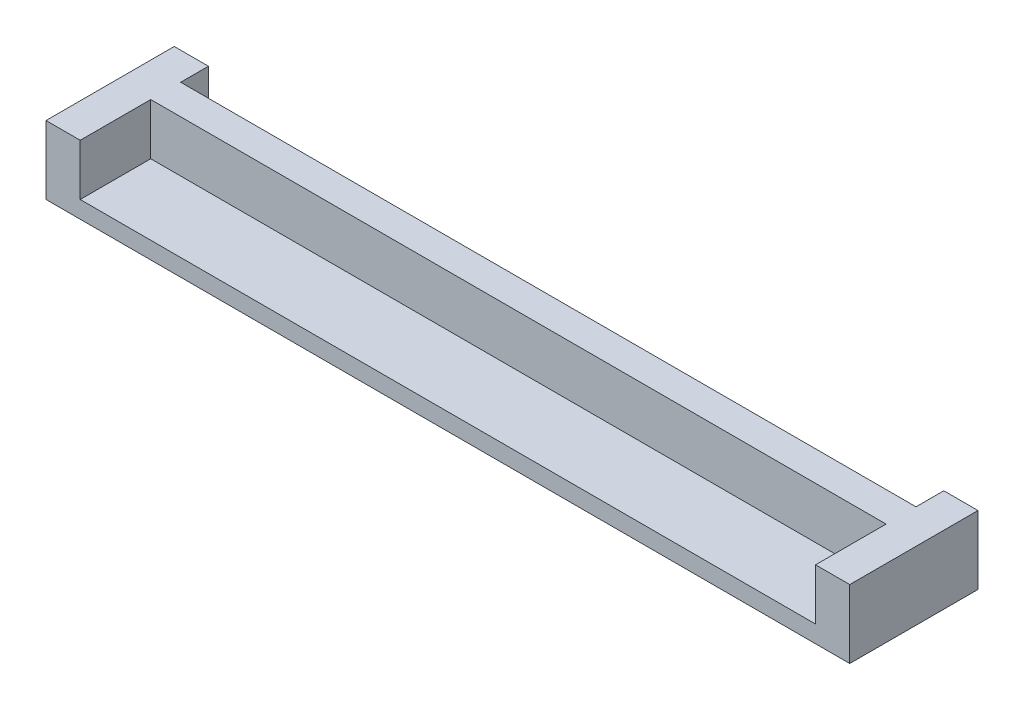
ISO-10303-21;
HEADER;
FILE_DESCRIPTION(('STEP AP214'),'2;1');
FILE_NAME('part.step','',(''),(''),'','','');
FILE_SCHEMA(('AUTOMOTIVE_DESIGN { 1 0 10303 214 1 1 1 1 }'));
ENDSEC;
DATA;
#1=APPLICATION_CONTEXT('core data for automotive mechanical design processes');
#2=APPLICATION_PROTOCOL_DEFINITION('international standard','automotive_design',2000,#1);
#3=PRODUCT_CONTEXT('',#1,'mechanical');
#4=PRODUCT('Part','Part','',(#3));
#5=PRODUCT_RELATED_PRODUCT_CATEGORY('part','',(#4));
#6=PRODUCT_DEFINITION_FORMATION('','',#4);
#7=PRODUCT_DEFINITION_CONTEXT('part definition',#1,'design');
#8=PRODUCT_DEFINITION('design','',#6,#7);
#9=PRODUCT_DEFINITION_SHAPE('','',#8);
#10=(LENGTH_UNIT() NAMED_UNIT(*) SI_UNIT(.MILLI.,.METRE.));
#11=(NAMED_UNIT(*) PLANE_ANGLE_UNIT() SI_UNIT($,.RADIAN.));
#12=(NAMED_UNIT(*) SI_UNIT($,.STERADIAN.) SOLID_ANGLE_UNIT());
#13=UNCERTAINTY_MEASURE_WITH_UNIT(LENGTH_MEASURE(1.E-05),#10,'distance_accuracy_value','');
#14=(GEOMETRIC_REPRESENTATION_CONTEXT(3) GLOBAL_UNCERTAINTY_ASSIGNED_CONTEXT((#13)) GLOBAL_UNIT_ASSIGNED_CONTEXT((#10,
#11,#12)) REPRESENTATION_CONTEXT('',''));
#15=CARTESIAN_POINT('',(0.,0.,0.));
#16=DIRECTION('',(0.,0.,1.));
#17=DIRECTION('',(1.,0.,0.));
#18=AXIS2_PLACEMENT_3D('',#15,#16,#17);
#19=CARTESIAN_POINT('',(57.138726824419,6.,-8.46922248144543));
#20=DIRECTION('',(1.,0.,0.));
#21=DIRECTION('',(0.,0.,-1.));
#22=AXIS2_PLACEMENT_3D('',#19,#20,#21);
#23=PLANE('',#22);
#24=DIRECTION('',(0.,-1.,0.));
#25=VECTOR('',#24,1.);
#26=CARTESIAN_POINT('',(57.138726824419,6.,-8.46922248144543));
#27=LINE('',#26,#25);
#28=CARTESIAN_POINT('',(57.138726824419,6.,-8.46922248144543));
#29=VERTEX_POINT('',#28);
#30=CARTESIAN_POINT('',(57.138726824419,-2.,-8.46922248144543));
#31=VERTEX_POINT('',#30);
#32=EDGE_CURVE('E116',#29,#31,#27,.T.);
#33=ORIENTED_EDGE('',*,*,#32,.T.);
#34=DIRECTION('',(0.,0.,-1.));
#35=VECTOR('',#34,1.);
#36=CARTESIAN_POINT('',(57.138726824419,-2.,6.53077751855457));
#37=LINE('',#36,#35);
#38=CARTESIAN_POINT('',(57.138726824419,-2.,6.53077751855457));
#39=VERTEX_POINT('',#38);
#40=EDGE_CURVE('E120',#39,#31,#37,.T.);
#41=ORIENTED_EDGE('',*,*,#40,.F.);
#42=DIRECTION('',(0.,-1.,0.));
#43=VECTOR('',#42,1.);
#44=CARTESIAN_POINT('',(57.138726824419,6.,6.53077751855457));
#45=LINE('',#44,#43);
#46=CARTESIAN_POINT('',(57.138726824419,6.,6.53077751855457));
#47=VERTEX_POINT('',#46);
#48=EDGE_CURVE('E11',#47,#39,#45,.T.);
#49=ORIENTED_EDGE('',*,*,#48,.F.);
#50=DIRECTION('',(0.,0.,1.));
#51=VECTOR('',#50,1.);
#52=CARTESIAN_POINT('',(57.138726824419,6.,-8.46922248144543));
#53=LINE('',#52,#51);
#54=EDGE_CURVE('E121',#29,#47,#53,.T.);
#55=ORIENTED_EDGE('',*,*,#54,.F.);
#56=EDGE_LOOP('',(#33,#41,#49,#55));
#57=FACE_BOUND('',#56,.T.);
#58=ADVANCED_FACE('F33',(#57),#23,.F.);
#59=CARTESIAN_POINT('',(61.138726824419,6.,-1.71922248144542));
#60=DIRECTION('',(-1.,0.,0.));
#61=DIRECTION('',(0.,0.,1.));
#62=AXIS2_PLACEMENT_3D('',#59,#60,#61);
#63=PLANE('',#62);
#64=DIRECTION('',(0.,0.,-1.));
#65=VECTOR('',#64,1.);
#66=CARTESIAN_POINT('',(61.138726824419,0.,-1.71922248144542));
#67=LINE('',#66,#65);
#68=CARTESIAN_POINT('',(61.138726824419,0.,6.53077751855457));
#69=VERTEX_POINT('',#68);
#70=CARTESIAN_POINT('',(61.138726824419,0.,-1.71922248144542));
#71=VERTEX_POINT('',#70);
#72=EDGE_CURVE('E149',#69,#71,#67,.T.);
#73=ORIENTED_EDGE('',*,*,#72,.T.);
#74=DIRECTION('',(0.,-1.,0.));
#75=VECTOR('',#74,1.);
#76=CARTESIAN_POINT('',(61.138726824419,6.,-1.71922248144542));
#77=LINE('',#76,#75);
#78=CARTESIAN_POINT('',(61.138726824419,6.,-1.71922248144542));
#79=VERTEX_POINT('',#78);
#80=EDGE_CURVE('E210',#79,#71,#77,.T.);
#81=ORIENTED_EDGE('',*,*,#80,.F.);
#82=DIRECTION('',(0.,0.,-1.));
#83=VECTOR('',#82,1.);
#84=CARTESIAN_POINT('',(61.138726824419,6.,-1.71922248144542));
#85=LINE('',#84,#83);
#86=CARTESIAN_POINT('',(61.138726824419,6.,6.53077751855457));
#87=VERTEX_POINT('',#86);
#88=EDGE_CURVE('E156',#87,#79,#85,.T.);
#89=ORIENTED_EDGE('',*,*,#88,.F.);
#90=DIRECTION('',(0.,-1.,0.));
#91=VECTOR('',#90,1.);
#92=CARTESIAN_POINT('',(61.138726824419,6.,6.53077751855457));
#93=LINE('',#92,#91);
#94=EDGE_CURVE('E41',#87,#69,#93,.T.);
#95=ORIENTED_EDGE('',*,*,#94,.T.);
#96=EDGE_LOOP('',(#73,#81,#89,#95));
#97=FACE_BOUND('',#96,.T.);
#98=ADVANCED_FACE('F216',(#97),#63,.F.);
#99=CARTESIAN_POINT('',(147.138726824419,6.,-1.71922248144543));
#100=DIRECTION('',(0.,0.,-1.));
#101=DIRECTION('',(-1.,0.,0.));
#102=AXIS2_PLACEMENT_3D('',#99,#100,#101);
#103=PLANE('',#102);
#104=DIRECTION('',(1.,0.,0.));
#105=VECTOR('',#104,1.);
#106=CARTESIAN_POINT('',(147.138726824419,0.,-1.71922248144543));
#107=LINE('',#106,#105);
#108=CARTESIAN_POINT('',(147.138726824419,0.,-1.71922248144543));
#109=VERTEX_POINT('',#108);
#110=EDGE_CURVE('E177',#71,#109,#107,.T.);
#111=ORIENTED_EDGE('',*,*,#110,.T.);
#112=DIRECTION('',(0.,-1.,0.));
#113=VECTOR('',#112,1.);
#114=CARTESIAN_POINT('',(147.138726824419,6.,-1.71922248144543));
#115=LINE('',#114,#113);
#116=CARTESIAN_POINT('',(147.138726824419,6.,-1.71922248144543));
#117=VERTEX_POINT('',#116);
#118=EDGE_CURVE('E207',#117,#109,#115,.T.);
#119=ORIENTED_EDGE('',*,*,#118,.F.);
#120=DIRECTION('',(1.,0.,0.));
#121=VECTOR('',#120,1.);
#122=CARTESIAN_POINT('',(147.138726824419,6.,-1.71922248144543));
#123=LINE('',#122,#121);
#124=EDGE_CURVE('E158',#79,#117,#123,.T.);
#125=ORIENTED_EDGE('',*,*,#124,.F.);
#126=ORIENTED_EDGE('',*,*,#80,.T.);
#127=EDGE_LOOP('',(#111,#119,#125,#126));
#128=FACE_BOUND('',#127,.T.);
#129=ADVANCED_FACE('F231',(#128),#103,.F.);
#130=CARTESIAN_POINT('',(147.138726824419,6.,-1.71922248144543));
#131=DIRECTION('',(1.,0.,0.));
#132=DIRECTION('',(0.,0.,-1.));
#133=AXIS2_PLACEMENT_3D('',#130,#131,#132);
#134=PLANE('',#133);
#135=DIRECTION('',(0.,0.,1.));
#136=VECTOR('',#135,1.);
#137=CARTESIAN_POINT('',(147.138726824419,0.,-1.71922248144543));
#138=LINE('',#137,#136);
#139=CARTESIAN_POINT('',(147.138726824419,0.,6.53077751855457));
#140=VERTEX_POINT('',#139);
#141=EDGE_CURVE('E180',#109,#140,#138,.T.);
#142=ORIENTED_EDGE('',*,*,#141,.T.);
#143=DIRECTION('',(0.,-1.,0.));
#144=VECTOR('',#143,1.);
#145=CARTESIAN_POINT('',(147.138726824419,6.,6.53077751855457));
#146=LINE('',#145,#144);
#147=CARTESIAN_POINT('',(147.138726824419,6.,6.53077751855457));
#148=VERTEX_POINT('',#147);
#149=EDGE_CURVE('E204',#148,#140,#146,.T.);
#150=ORIENTED_EDGE('',*,*,#149,.F.);
#151=DIRECTION('',(0.,0.,1.));
#152=VECTOR('',#151,1.);
#153=CARTESIAN_POINT('',(147.138726824419,6.,-1.71922248144543));
#154=LINE('',#153,#152);
#155=EDGE_CURVE('E160',#117,#148,#154,.T.);
#156=ORIENTED_EDGE('',*,*,#155,.F.);
#157=ORIENTED_EDGE('',*,*,#118,.T.);
#158=EDGE_LOOP('',(#142,#150,#156,#157));
#159=FACE_BOUND('',#158,.T.);
#160=ADVANCED_FACE('F226',(#159),#134,.F.);
#161=CARTESIAN_POINT('',(147.138726824419,6.,6.53077751855457));
#162=DIRECTION('',(0.,0.,-1.));
#163=DIRECTION('',(-1.,0.,0.));
#164=AXIS2_PLACEMENT_3D('',#161,#162,#163);
#165=PLANE('',#164);
#166=ORIENTED_EDGE('',*,*,#149,.T.);
#167=DIRECTION('',(-1.,0.,0.));
#168=VECTOR('',#167,1.);
#169=CARTESIAN_POINT('',(57.138726824419,0.,6.53077751855457));
#170=LINE('',#169,#168);
#171=EDGE_CURVE('E141',#140,#69,#170,.T.);
#172=ORIENTED_EDGE('',*,*,#171,.T.);
#173=ORIENTED_EDGE('',*,*,#94,.F.);
#174=DIRECTION('',(1.,0.,0.));
#175=VECTOR('',#174,1.);
#176=CARTESIAN_POINT('',(57.138726824419,6.,6.53077751855457));
#177=LINE('',#176,#175);
#178=EDGE_CURVE('E153',#47,#87,#177,.T.);
#179=ORIENTED_EDGE('',*,*,#178,.F.);
#180=ORIENTED_EDGE('',*,*,#48,.T.);
#181=DIRECTION('',(-1.,0.,0.));
#182=VECTOR('',#181,1.);
#183=CARTESIAN_POINT('',(57.138726824419,-2.,6.53077751855457));
#184=LINE('',#183,#182);
#185=CARTESIAN_POINT('',(151.138726824419,-2.,6.53077751855457));
#186=VERTEX_POINT('',#185);
#187=EDGE_CURVE('E140',#186,#39,#184,.T.);
#188=ORIENTED_EDGE('',*,*,#187,.F.);
#189=DIRECTION('',(0.,-1.,0.));
#190=VECTOR('',#189,1.);
#191=CARTESIAN_POINT('',(151.138726824419,6.,6.53077751855457));
#192=LINE('',#191,#190);
#193=CARTESIAN_POINT('',(151.138726824419,6.,6.53077751855457));
#194=VERTEX_POINT('',#193);
#195=EDGE_CURVE('E202',#194,#186,#192,.T.);
#196=ORIENTED_EDGE('',*,*,#195,.F.);
#197=DIRECTION('',(1.,0.,0.));
#198=VECTOR('',#197,1.);
#199=CARTESIAN_POINT('',(147.138726824419,6.,6.53077751855457));
#200=LINE('',#199,#198);
#201=EDGE_CURVE('E162',#148,#194,#200,.T.);
#202=ORIENTED_EDGE('',*,*,#201,.F.);
#203=EDGE_LOOP('',(#166,#172,#173,#179,#180,#188,#196,#202));
#204=FACE_BOUND('',#203,.T.);
#205=ADVANCED_FACE('F219',(#204),#165,.F.);
#206=CARTESIAN_POINT('',(151.138726824419,6.,-8.46922248144543));
#207=DIRECTION('',(-1.,0.,0.));
#208=DIRECTION('',(0.,0.,1.));
#209=AXIS2_PLACEMENT_3D('',#206,#207,#208);
#210=PLANE('',#209);
#211=ORIENTED_EDGE('',*,*,#195,.T.);
#212=DIRECTION('',(0.,0.,1.));
#213=VECTOR('',#212,1.);
#214=CARTESIAN_POINT('',(151.138726824419,-2.,6.53077751855457));
#215=LINE('',#214,#213);
#216=CARTESIAN_POINT('',(151.138726824419,-2.,-8.46922248144543));
#217=VERTEX_POINT('',#216);
#218=EDGE_CURVE('E135',#217,#186,#215,.T.);
#219=ORIENTED_EDGE('',*,*,#218,.F.);
#220=DIRECTION('',(0.,-1.,0.));
#221=VECTOR('',#220,1.);
#222=CARTESIAN_POINT('',(151.138726824419,6.,-8.46922248144543));
#223=LINE('',#222,#221);
#224=CARTESIAN_POINT('',(151.138726824419,6.,-8.46922248144543));
#225=VERTEX_POINT('',#224);
#226=EDGE_CURVE('E131',#225,#217,#223,.T.);
#227=ORIENTED_EDGE('',*,*,#226,.F.);
#228=DIRECTION('',(0.,0.,-1.));
#229=VECTOR('',#228,1.);
#230=CARTESIAN_POINT('',(151.138726824419,6.,-8.46922248144543));
#231=LINE('',#230,#229);
#232=EDGE_CURVE('E164',#194,#225,#231,.T.);
#233=ORIENTED_EDGE('',*,*,#232,.F.);
#234=EDGE_LOOP('',(#211,#219,#227,#233));
#235=FACE_BOUND('',#234,.T.);
#236=ADVANCED_FACE('F236',(#235),#210,.F.);
#237=CARTESIAN_POINT('',(147.138726824419,6.,-8.46922248144543));
#238=DIRECTION('',(1.,0.,0.));
#239=DIRECTION('',(0.,0.,-1.));
#240=AXIS2_PLACEMENT_3D('',#237,#238,#239);
#241=PLANE('',#240);
#242=DIRECTION('',(0.,0.,1.));
#243=VECTOR('',#242,1.);
#244=CARTESIAN_POINT('',(147.138726824419,0.,-8.46922248144543));
#245=LINE('',#244,#243);
#246=CARTESIAN_POINT('',(147.138726824419,0.,-8.46922248144543));
#247=VERTEX_POINT('',#246);
#248=CARTESIAN_POINT('',(147.138726824419,0.,-5.21922248144543));
#249=VERTEX_POINT('',#248);
#250=EDGE_CURVE('E183',#247,#249,#245,.T.);
#251=ORIENTED_EDGE('',*,*,#250,.T.);
#252=DIRECTION('',(0.,-1.,0.));
#253=VECTOR('',#252,1.);
#254=CARTESIAN_POINT('',(147.138726824419,6.,-5.21922248144543));
#255=LINE('',#254,#253);
#256=CARTESIAN_POINT('',(147.138726824419,6.,-5.21922248144543));
#257=VERTEX_POINT('',#256);
#258=EDGE_CURVE('E195',#257,#249,#255,.T.);
#259=ORIENTED_EDGE('',*,*,#258,.F.);
#260=DIRECTION('',(0.,0.,1.));
#261=VECTOR('',#260,1.);
#262=CARTESIAN_POINT('',(147.138726824419,6.,-8.46922248144543));
#263=LINE('',#262,#261);
#264=CARTESIAN_POINT('',(147.138726824419,6.,-8.46922248144543));
#265=VERTEX_POINT('',#264);
#266=EDGE_CURVE('E168',#265,#257,#263,.T.);
#267=ORIENTED_EDGE('',*,*,#266,.F.);
#268=DIRECTION('',(0.,-1.,0.));
#269=VECTOR('',#268,1.);
#270=CARTESIAN_POINT('',(147.138726824419,6.,-8.46922248144543));
#271=LINE('',#270,#269);
#272=EDGE_CURVE('E198',#265,#247,#271,.T.);
#273=ORIENTED_EDGE('',*,*,#272,.T.);
#274=EDGE_LOOP('',(#251,#259,#267,#273));
#275=FACE_BOUND('',#274,.T.);
#276=ADVANCED_FACE('F241',(#275),#241,.F.);
#277=CARTESIAN_POINT('',(61.138726824419,6.,-5.21922248144543));
#278=DIRECTION('',(0.,0.,1.));
#279=DIRECTION('',(1.,0.,0.));
#280=AXIS2_PLACEMENT_3D('',#277,#278,#279);
#281=PLANE('',#280);
#282=DIRECTION('',(-1.,0.,0.));
#283=VECTOR('',#282,1.);
#284=CARTESIAN_POINT('',(61.138726824419,0.,-5.21922248144543));
#285=LINE('',#284,#283);
#286=CARTESIAN_POINT('',(61.138726824419,0.,-5.21922248144543));
#287=VERTEX_POINT('',#286);
#288=EDGE_CURVE('E186',#249,#287,#285,.T.);
#289=ORIENTED_EDGE('',*,*,#288,.T.);
#290=DIRECTION('',(0.,-1.,0.));
#291=VECTOR('',#290,1.);
#292=CARTESIAN_POINT('',(61.138726824419,6.,-5.21922248144543));
#293=LINE('',#292,#291);
#294=CARTESIAN_POINT('',(61.138726824419,6.,-5.21922248144543));
#295=VERTEX_POINT('',#294);
#296=EDGE_CURVE('E192',#295,#287,#293,.T.);
#297=ORIENTED_EDGE('',*,*,#296,.F.);
#298=DIRECTION('',(-1.,0.,0.));
#299=VECTOR('',#298,1.);
#300=CARTESIAN_POINT('',(61.138726824419,6.,-5.21922248144543));
#301=LINE('',#300,#299);
#302=EDGE_CURVE('E170',#257,#295,#301,.T.);
#303=ORIENTED_EDGE('',*,*,#302,.F.);
#304=ORIENTED_EDGE('',*,*,#258,.T.);
#305=EDGE_LOOP('',(#289,#297,#303,#304));
#306=FACE_BOUND('',#305,.T.);
#307=ADVANCED_FACE('F245',(#306),#281,.F.);
#308=CARTESIAN_POINT('',(61.138726824419,6.,-8.46922248144543));
#309=DIRECTION('',(-1.,0.,0.));
#310=DIRECTION('',(0.,0.,1.));
#311=AXIS2_PLACEMENT_3D('',#308,#309,#310);
#312=PLANE('',#311);
#313=DIRECTION('',(0.,0.,-1.));
#314=VECTOR('',#313,1.);
#315=CARTESIAN_POINT('',(61.138726824419,0.,-8.46922248144543));
#316=LINE('',#315,#314);
#317=CARTESIAN_POINT('',(61.138726824419,0.,-8.46922248144543));
#318=VERTEX_POINT('',#317);
#319=EDGE_CURVE('E154',#287,#318,#316,.T.);
#320=ORIENTED_EDGE('',*,*,#319,.T.);
#321=DIRECTION('',(0.,-1.,0.));
#322=VECTOR('',#321,1.);
#323=CARTESIAN_POINT('',(61.138726824419,6.,-8.46922248144543));
#324=LINE('',#323,#322);
#325=CARTESIAN_POINT('',(61.138726824419,6.,-8.46922248144543));
#326=VERTEX_POINT('',#325);
#327=EDGE_CURVE('E123',#326,#318,#324,.T.);
#328=ORIENTED_EDGE('',*,*,#327,.F.);
#329=DIRECTION('',(0.,0.,-1.));
#330=VECTOR('',#329,1.);
#331=CARTESIAN_POINT('',(61.138726824419,6.,-8.46922248144543));
#332=LINE('',#331,#330);
#333=EDGE_CURVE('E172',#295,#326,#332,.T.);
#334=ORIENTED_EDGE('',*,*,#333,.F.);
#335=ORIENTED_EDGE('',*,*,#296,.T.);
#336=EDGE_LOOP('',(#320,#328,#334,#335));
#337=FACE_BOUND('',#336,.T.);
#338=ADVANCED_FACE('F249',(#337),#312,.F.);
#339=CARTESIAN_POINT('',(57.138726824419,6.,-8.46922248144543));
#340=DIRECTION('',(0.,0.,1.));
#341=DIRECTION('',(1.,0.,0.));
#342=AXIS2_PLACEMENT_3D('',#339,#340,#341);
#343=PLANE('',#342);
#344=ORIENTED_EDGE('',*,*,#327,.T.);
#345=DIRECTION('',(1.,0.,0.));
#346=VECTOR('',#345,1.);
#347=CARTESIAN_POINT('',(57.138726824419,0.,-8.46922248144543));
#348=LINE('',#347,#346);
#349=EDGE_CURVE('E144',#318,#247,#348,.T.);
#350=ORIENTED_EDGE('',*,*,#349,.T.);
#351=ORIENTED_EDGE('',*,*,#272,.F.);
#352=DIRECTION('',(-1.,0.,0.));
#353=VECTOR('',#352,1.);
#354=CARTESIAN_POINT('',(147.138726824419,6.,-8.46922248144543));
#355=LINE('',#354,#353);
#356=EDGE_CURVE('E166',#225,#265,#355,.T.);
#357=ORIENTED_EDGE('',*,*,#356,.F.);
#358=ORIENTED_EDGE('',*,*,#226,.T.);
#359=DIRECTION('',(1.,0.,0.));
#360=VECTOR('',#359,1.);
#361=CARTESIAN_POINT('',(57.138726824419,-2.,-8.46922248144543));
#362=LINE('',#361,#360);
#363=EDGE_CURVE('E126',#31,#217,#362,.T.);
#364=ORIENTED_EDGE('',*,*,#363,.F.);
#365=ORIENTED_EDGE('',*,*,#32,.F.);
#366=DIRECTION('',(-1.,0.,0.));
#367=VECTOR('',#366,1.);
#368=CARTESIAN_POINT('',(57.138726824419,6.,-8.46922248144543));
#369=LINE('',#368,#367);
#370=EDGE_CURVE('E48',#326,#29,#369,.T.);
#371=ORIENTED_EDGE('',*,*,#370,.F.);
#372=EDGE_LOOP('',(#344,#350,#351,#357,#358,#364,#365,#371));
#373=FACE_BOUND('',#372,.T.);
#374=ADVANCED_FACE('F128',(#373),#343,.F.);
#375=CARTESIAN_POINT('',(0.,6.,0.));
#376=DIRECTION('',(0.,1.,0.));
#377=DIRECTION('',(0.,0.,1.));
#378=AXIS2_PLACEMENT_3D('',#375,#376,#377);
#379=PLANE('',#378);
#380=ORIENTED_EDGE('',*,*,#54,.T.);
#381=ORIENTED_EDGE('',*,*,#178,.T.);
#382=ORIENTED_EDGE('',*,*,#88,.T.);
#383=ORIENTED_EDGE('',*,*,#124,.T.);
#384=ORIENTED_EDGE('',*,*,#155,.T.);
#385=ORIENTED_EDGE('',*,*,#201,.T.);
#386=ORIENTED_EDGE('',*,*,#232,.T.);
#387=ORIENTED_EDGE('',*,*,#356,.T.);
#388=ORIENTED_EDGE('',*,*,#266,.T.);
#389=ORIENTED_EDGE('',*,*,#302,.T.);
#390=ORIENTED_EDGE('',*,*,#333,.T.);
#391=ORIENTED_EDGE('',*,*,#370,.T.);
#392=EDGE_LOOP('',(#380,#381,#382,#383,#384,#385,#386,#387,#388,#389,#390,#391));
#393=FACE_BOUND('',#392,.T.);
#394=ADVANCED_FACE('F232',(#393),#379,.T.);
#395=CARTESIAN_POINT('',(0.,0.,0.));
#396=DIRECTION('',(0.,-1.,0.));
#397=DIRECTION('',(0.,0.,-1.));
#398=AXIS2_PLACEMENT_3D('',#395,#396,#397);
#399=PLANE('',#398);
#400=ORIENTED_EDGE('',*,*,#319,.F.);
#401=ORIENTED_EDGE('',*,*,#288,.F.);
#402=ORIENTED_EDGE('',*,*,#250,.F.);
#403=ORIENTED_EDGE('',*,*,#349,.F.);
#404=EDGE_LOOP('',(#400,#401,#402,#403));
#405=FACE_BOUND('',#404,.T.);
#406=ADVANCED_FACE('F251',(#405),#399,.F.);
#407=CARTESIAN_POINT('',(0.,-2.,0.));
#408=DIRECTION('',(0.,-1.,0.));
#409=DIRECTION('',(0.,0.,-1.));
#410=AXIS2_PLACEMENT_3D('',#407,#408,#409);
#411=PLANE('',#410);
#412=ORIENTED_EDGE('',*,*,#40,.T.);
#413=ORIENTED_EDGE('',*,*,#363,.T.);
#414=ORIENTED_EDGE('',*,*,#218,.T.);
#415=ORIENTED_EDGE('',*,*,#187,.T.);
#416=EDGE_LOOP('',(#412,#413,#414,#415));
#417=FACE_BOUND('',#416,.T.);
#418=ADVANCED_FACE('F138',(#417),#411,.T.);
#419=ORIENTED_EDGE('',*,*,#141,.F.);
#420=ORIENTED_EDGE('',*,*,#110,.F.);
#421=ORIENTED_EDGE('',*,*,#72,.F.);
#422=ORIENTED_EDGE('',*,*,#171,.F.);
#423=EDGE_LOOP('',(#419,#420,#421,#422));
#424=FACE_BOUND('',#423,.T.);
#425=ADVANCED_FACE('F223',(#424),#399,.F.);
#426=CLOSED_SHELL('',(#58,#98,#129,#160,#205,#236,#276,#307,#338,#374,#394,#406,#418,#425));
#427=MANIFOLD_SOLID_BREP('B2',#426);
#428=ADVANCED_BREP_SHAPE_REPRESENTATION('',(#18,#427),#14);
#429=SHAPE_DEFINITION_REPRESENTATION(#9,#428);
ENDSEC;
END-ISO-10303-21;
